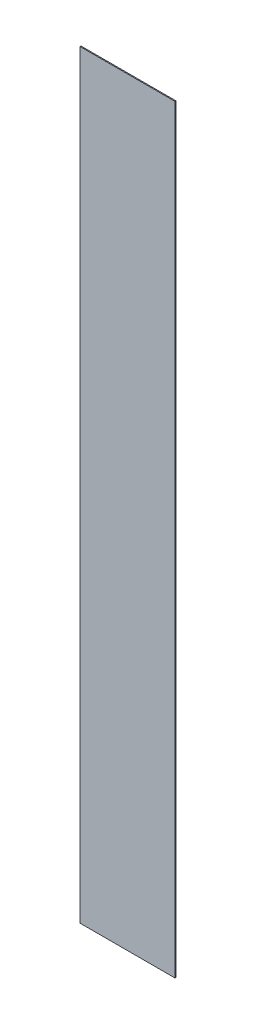
ISO-10303-21;
HEADER;
FILE_DESCRIPTION(('STEP AP214'),'2;1');
FILE_NAME('part.step','',(''),(''),'','','');
FILE_SCHEMA(('AUTOMOTIVE_DESIGN { 1 0 10303 214 1 1 1 1 }'));
ENDSEC;
DATA;
#1=APPLICATION_CONTEXT('core data for automotive mechanical design processes');
#2=APPLICATION_PROTOCOL_DEFINITION('international standard','automotive_design',2000,#1);
#3=PRODUCT_CONTEXT('',#1,'mechanical');
#4=PRODUCT('Part','Part','',(#3));
#5=PRODUCT_RELATED_PRODUCT_CATEGORY('part','',(#4));
#6=PRODUCT_DEFINITION_FORMATION('','',#4);
#7=PRODUCT_DEFINITION_CONTEXT('part definition',#1,'design');
#8=PRODUCT_DEFINITION('design','',#6,#7);
#9=PRODUCT_DEFINITION_SHAPE('','',#8);
#10=(LENGTH_UNIT() NAMED_UNIT(*) SI_UNIT(.MILLI.,.METRE.));
#11=(NAMED_UNIT(*) PLANE_ANGLE_UNIT() SI_UNIT($,.RADIAN.));
#12=(NAMED_UNIT(*) SI_UNIT($,.STERADIAN.) SOLID_ANGLE_UNIT());
#13=UNCERTAINTY_MEASURE_WITH_UNIT(LENGTH_MEASURE(1.E-05),#10,'distance_accuracy_value','');
#14=(GEOMETRIC_REPRESENTATION_CONTEXT(3) GLOBAL_UNCERTAINTY_ASSIGNED_CONTEXT((#13)) GLOBAL_UNIT_ASSIGNED_CONTEXT((#10,
#11,#12)) REPRESENTATION_CONTEXT('',''));
#15=CARTESIAN_POINT('',(0.,0.,0.));
#16=DIRECTION('',(0.,0.,1.));
#17=DIRECTION('',(1.,0.,0.));
#18=AXIS2_PLACEMENT_3D('',#15,#16,#17);
#19=CARTESIAN_POINT('',(0.,0.,0.508));
#20=DIRECTION('',(1.,0.,0.));
#21=DIRECTION('',(0.,0.,-1.));
#22=AXIS2_PLACEMENT_3D('',#19,#20,#21);
#23=PLANE('',#22);
#24=DIRECTION('',(0.,-1.,0.));
#25=VECTOR('',#24,1.);
#26=CARTESIAN_POINT('',(0.,0.,0.));
#27=LINE('',#26,#25);
#28=CARTESIAN_POINT('',(0.,406.4,0.));
#29=VERTEX_POINT('',#28);
#30=CARTESIAN_POINT('',(0.,0.,0.));
#31=VERTEX_POINT('',#30);
#32=EDGE_CURVE('E95',#29,#31,#27,.T.);
#33=ORIENTED_EDGE('',*,*,#32,.T.);
#34=DIRECTION('',(0.,0.,-1.));
#35=VECTOR('',#34,1.);
#36=CARTESIAN_POINT('',(0.,0.,0.508));
#37=LINE('',#36,#35);
#38=CARTESIAN_POINT('',(0.,0.,0.508));
#39=VERTEX_POINT('',#38);
#40=EDGE_CURVE('E11',#39,#31,#37,.T.);
#41=ORIENTED_EDGE('',*,*,#40,.F.);
#42=DIRECTION('',(0.,-1.,0.));
#43=VECTOR('',#42,1.);
#44=CARTESIAN_POINT('',(0.,0.,0.508));
#45=LINE('',#44,#43);
#46=CARTESIAN_POINT('',(0.,406.4,0.508));
#47=VERTEX_POINT('',#46);
#48=EDGE_CURVE('E83',#47,#39,#45,.T.);
#49=ORIENTED_EDGE('',*,*,#48,.F.);
#50=DIRECTION('',(0.,0.,-1.));
#51=VECTOR('',#50,1.);
#52=CARTESIAN_POINT('',(0.,406.4,0.508));
#53=LINE('',#52,#51);
#54=EDGE_CURVE('E91',#47,#29,#53,.T.);
#55=ORIENTED_EDGE('',*,*,#54,.T.);
#56=EDGE_LOOP('',(#33,#41,#49,#55));
#57=FACE_BOUND('',#56,.T.);
#58=ADVANCED_FACE('F32',(#57),#23,.F.);
#59=CARTESIAN_POINT('',(0.,0.,0.508));
#60=DIRECTION('',(0.,1.,0.));
#61=DIRECTION('',(-1.,0.,0.));
#62=AXIS2_PLACEMENT_3D('',#59,#60,#61);
#63=PLANE('',#62);
#64=DIRECTION('',(1.,0.,0.));
#65=VECTOR('',#64,1.);
#66=CARTESIAN_POINT('',(0.,0.,0.));
#67=LINE('',#66,#65);
#68=CARTESIAN_POINT('',(50.8,0.,0.));
#69=VERTEX_POINT('',#68);
#70=EDGE_CURVE('E87',#31,#69,#67,.T.);
#71=ORIENTED_EDGE('',*,*,#70,.T.);
#72=DIRECTION('',(0.,0.,-1.));
#73=VECTOR('',#72,1.);
#74=CARTESIAN_POINT('',(50.8,0.,0.508));
#75=LINE('',#74,#73);
#76=CARTESIAN_POINT('',(50.8,0.,0.508));
#77=VERTEX_POINT('',#76);
#78=EDGE_CURVE('E40',#77,#69,#75,.T.);
#79=ORIENTED_EDGE('',*,*,#78,.F.);
#80=DIRECTION('',(1.,0.,0.));
#81=VECTOR('',#80,1.);
#82=CARTESIAN_POINT('',(0.,0.,0.508));
#83=LINE('',#82,#81);
#84=EDGE_CURVE('E78',#39,#77,#83,.T.);
#85=ORIENTED_EDGE('',*,*,#84,.F.);
#86=ORIENTED_EDGE('',*,*,#40,.T.);
#87=EDGE_LOOP('',(#71,#79,#85,#86));
#88=FACE_BOUND('',#87,.T.);
#89=ADVANCED_FACE('F86',(#88),#63,.F.);
#90=CARTESIAN_POINT('',(50.8,0.,0.508));
#91=DIRECTION('',(-1.,0.,0.));
#92=DIRECTION('',(0.,0.,1.));
#93=AXIS2_PLACEMENT_3D('',#90,#91,#92);
#94=PLANE('',#93);
#95=DIRECTION('',(0.,1.,0.));
#96=VECTOR('',#95,1.);
#97=CARTESIAN_POINT('',(50.8,0.,0.));
#98=LINE('',#97,#96);
#99=CARTESIAN_POINT('',(50.8,406.4,0.));
#100=VERTEX_POINT('',#99);
#101=EDGE_CURVE('E65',#69,#100,#98,.T.);
#102=ORIENTED_EDGE('',*,*,#101,.T.);
#103=DIRECTION('',(0.,0.,-1.));
#104=VECTOR('',#103,1.);
#105=CARTESIAN_POINT('',(50.8,406.4,0.508));
#106=LINE('',#105,#104);
#107=CARTESIAN_POINT('',(50.8,406.4,0.508));
#108=VERTEX_POINT('',#107);
#109=EDGE_CURVE('E88',#108,#100,#106,.T.);
#110=ORIENTED_EDGE('',*,*,#109,.F.);
#111=DIRECTION('',(0.,1.,0.));
#112=VECTOR('',#111,1.);
#113=CARTESIAN_POINT('',(50.8,0.,0.508));
#114=LINE('',#113,#112);
#115=EDGE_CURVE('E81',#77,#108,#114,.T.);
#116=ORIENTED_EDGE('',*,*,#115,.F.);
#117=ORIENTED_EDGE('',*,*,#78,.T.);
#118=EDGE_LOOP('',(#102,#110,#116,#117));
#119=FACE_BOUND('',#118,.T.);
#120=ADVANCED_FACE('F89',(#119),#94,.F.);
#121=CARTESIAN_POINT('',(0.,406.4,0.508));
#122=DIRECTION('',(0.,-1.,0.));
#123=DIRECTION('',(0.,0.,-1.));
#124=AXIS2_PLACEMENT_3D('',#121,#122,#123);
#125=PLANE('',#124);
#126=DIRECTION('',(-1.,0.,0.));
#127=VECTOR('',#126,1.);
#128=CARTESIAN_POINT('',(0.,406.4,0.));
#129=LINE('',#128,#127);
#130=EDGE_CURVE('E71',#100,#29,#129,.T.);
#131=ORIENTED_EDGE('',*,*,#130,.T.);
#132=ORIENTED_EDGE('',*,*,#54,.F.);
#133=DIRECTION('',(-1.,0.,0.));
#134=VECTOR('',#133,1.);
#135=CARTESIAN_POINT('',(0.,406.4,0.508));
#136=LINE('',#135,#134);
#137=EDGE_CURVE('E48',#108,#47,#136,.T.);
#138=ORIENTED_EDGE('',*,*,#137,.F.);
#139=ORIENTED_EDGE('',*,*,#109,.T.);
#140=EDGE_LOOP('',(#131,#132,#138,#139));
#141=FACE_BOUND('',#140,.T.);
#142=ADVANCED_FACE('F102',(#141),#125,.F.);
#143=CARTESIAN_POINT('',(0.,0.,0.508));
#144=DIRECTION('',(0.,0.,-1.));
#145=DIRECTION('',(-1.,0.,0.));
#146=AXIS2_PLACEMENT_3D('',#143,#144,#145);
#147=PLANE('',#146);
#148=ORIENTED_EDGE('',*,*,#48,.T.);
#149=ORIENTED_EDGE('',*,*,#84,.T.);
#150=ORIENTED_EDGE('',*,*,#115,.T.);
#151=ORIENTED_EDGE('',*,*,#137,.T.);
#152=EDGE_LOOP('',(#148,#149,#150,#151));
#153=FACE_BOUND('',#152,.T.);
#154=ADVANCED_FACE('F79',(#153),#147,.F.);
#155=CARTESIAN_POINT('',(0.,0.,0.));
#156=DIRECTION('',(0.,0.,-1.));
#157=DIRECTION('',(-1.,0.,0.));
#158=AXIS2_PLACEMENT_3D('',#155,#156,#157);
#159=PLANE('',#158);
#160=ORIENTED_EDGE('',*,*,#32,.F.);
#161=ORIENTED_EDGE('',*,*,#130,.F.);
#162=ORIENTED_EDGE('',*,*,#101,.F.);
#163=ORIENTED_EDGE('',*,*,#70,.F.);
#164=EDGE_LOOP('',(#160,#161,#162,#163));
#165=FACE_BOUND('',#164,.T.);
#166=ADVANCED_FACE('F105',(#165),#159,.T.);
#167=CLOSED_SHELL('',(#58,#89,#120,#142,#154,#166));
#168=MANIFOLD_SOLID_BREP('B2',#167);
#169=ADVANCED_BREP_SHAPE_REPRESENTATION('',(#18,#168),#14);
#170=SHAPE_DEFINITION_REPRESENTATION(#9,#169);
ENDSEC;
END-ISO-10303-21;
